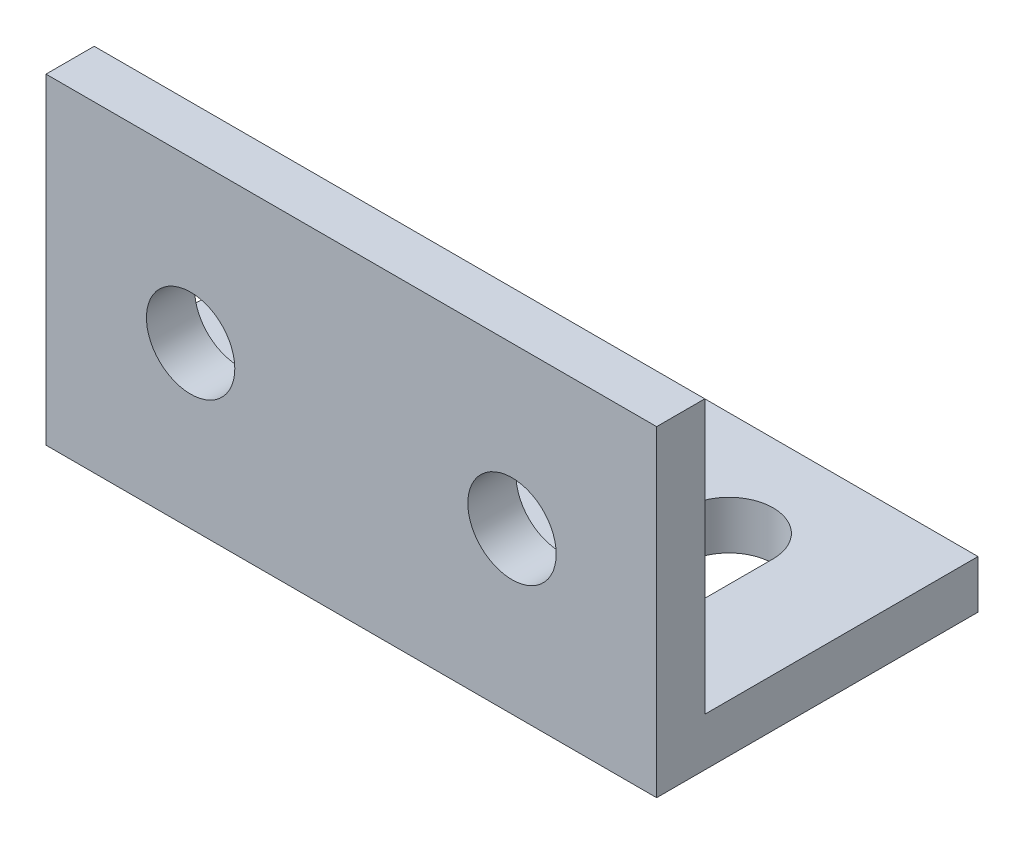
ISO-10303-21;
HEADER;
FILE_DESCRIPTION(('STEP AP214'),'2;1');
FILE_NAME('part.step','',(''),(''),'','','');
FILE_SCHEMA(('AUTOMOTIVE_DESIGN { 1 0 10303 214 1 1 1 1 }'));
ENDSEC;
DATA;
#1=APPLICATION_CONTEXT('core data for automotive mechanical design processes');
#2=APPLICATION_PROTOCOL_DEFINITION('international standard','automotive_design',2000,#1);
#3=PRODUCT_CONTEXT('',#1,'mechanical');
#4=PRODUCT('Part','Part','',(#3));
#5=PRODUCT_RELATED_PRODUCT_CATEGORY('part','',(#4));
#6=PRODUCT_DEFINITION_FORMATION('','',#4);
#7=PRODUCT_DEFINITION_CONTEXT('part definition',#1,'design');
#8=PRODUCT_DEFINITION('design','',#6,#7);
#9=PRODUCT_DEFINITION_SHAPE('','',#8);
#10=(LENGTH_UNIT() NAMED_UNIT(*) SI_UNIT(.MILLI.,.METRE.));
#11=(NAMED_UNIT(*) PLANE_ANGLE_UNIT() SI_UNIT($,.RADIAN.));
#12=(NAMED_UNIT(*) SI_UNIT($,.STERADIAN.) SOLID_ANGLE_UNIT());
#13=UNCERTAINTY_MEASURE_WITH_UNIT(LENGTH_MEASURE(1.E-05),#10,'distance_accuracy_value','');
#14=(GEOMETRIC_REPRESENTATION_CONTEXT(3) GLOBAL_UNCERTAINTY_ASSIGNED_CONTEXT((#13)) GLOBAL_UNIT_ASSIGNED_CONTEXT((#10,
#11,#12)) REPRESENTATION_CONTEXT('',''));
#15=CARTESIAN_POINT('',(0.,0.,0.));
#16=DIRECTION('',(0.,0.,1.));
#17=DIRECTION('',(1.,0.,0.));
#18=AXIS2_PLACEMENT_3D('',#15,#16,#17);
#19=CARTESIAN_POINT('',(38.,20.,0.));
#20=DIRECTION('',(0.,0.,-1.));
#21=DIRECTION('',(0.,1.,0.));
#22=AXIS2_PLACEMENT_3D('',#19,#20,#21);
#23=PLANE('',#22);
#24=CARTESIAN_POINT('',(9.,10.,0.));
#25=DIRECTION('',(0.,0.,1.));
#26=DIRECTION('',(1.,0.,0.));
#27=AXIS2_PLACEMENT_3D('',#24,#25,#26);
#28=CIRCLE('',#27,2.75);
#29=CARTESIAN_POINT('',(11.75,10.,0.));
#30=VERTEX_POINT('',#29);
#31=EDGE_CURVE('E207',#30,#30,#28,.T.);
#32=ORIENTED_EDGE('',*,*,#31,.F.);
#33=EDGE_LOOP('',(#32));
#34=FACE_BOUND('',#33,.T.);
#35=CARTESIAN_POINT('',(29.,10.,0.));
#36=DIRECTION('',(0.,0.,1.));
#37=DIRECTION('',(1.,0.,0.));
#38=AXIS2_PLACEMENT_3D('',#35,#36,#37);
#39=CIRCLE('',#38,2.75);
#40=CARTESIAN_POINT('',(31.75,10.,0.));
#41=VERTEX_POINT('',#40);
#42=EDGE_CURVE('E176',#41,#41,#39,.T.);
#43=ORIENTED_EDGE('',*,*,#42,.F.);
#44=EDGE_LOOP('',(#43));
#45=FACE_BOUND('',#44,.T.);
#46=DIRECTION('',(0.,-1.,0.));
#47=VECTOR('',#46,1.);
#48=CARTESIAN_POINT('',(0.,20.,0.));
#49=LINE('',#48,#47);
#50=CARTESIAN_POINT('',(0.,20.,0.));
#51=VERTEX_POINT('',#50);
#52=CARTESIAN_POINT('',(0.,0.,0.));
#53=VERTEX_POINT('',#52);
#54=EDGE_CURVE('E236',#51,#53,#49,.T.);
#55=ORIENTED_EDGE('',*,*,#54,.T.);
#56=DIRECTION('',(-1.,0.,0.));
#57=VECTOR('',#56,1.);
#58=CARTESIAN_POINT('',(38.,0.,0.));
#59=LINE('',#58,#57);
#60=CARTESIAN_POINT('',(38.,0.,0.));
#61=VERTEX_POINT('',#60);
#62=EDGE_CURVE('E274',#61,#53,#59,.T.);
#63=ORIENTED_EDGE('',*,*,#62,.F.);
#64=DIRECTION('',(0.,-1.,0.));
#65=VECTOR('',#64,1.);
#66=CARTESIAN_POINT('',(38.,20.,0.));
#67=LINE('',#66,#65);
#68=CARTESIAN_POINT('',(38.,20.,0.));
#69=VERTEX_POINT('',#68);
#70=EDGE_CURVE('E215',#69,#61,#67,.T.);
#71=ORIENTED_EDGE('',*,*,#70,.F.);
#72=DIRECTION('',(-1.,0.,0.));
#73=VECTOR('',#72,1.);
#74=CARTESIAN_POINT('',(38.,20.,0.));
#75=LINE('',#74,#73);
#76=EDGE_CURVE('E235',#69,#51,#75,.T.);
#77=ORIENTED_EDGE('',*,*,#76,.T.);
#78=EDGE_LOOP('',(#55,#63,#71,#77));
#79=FACE_BOUND('',#78,.T.);
#80=ADVANCED_FACE('F39',(#34,#45,#79),#23,.F.);
#81=CARTESIAN_POINT('',(38.,0.,0.));
#82=DIRECTION('',(0.,1.,0.));
#83=DIRECTION('',(0.,0.,1.));
#84=AXIS2_PLACEMENT_3D('',#81,#82,#83);
#85=PLANE('',#84);
#86=DIRECTION('',(0.,0.,1.));
#87=VECTOR('',#86,1.);
#88=CARTESIAN_POINT('',(11.75,0.,-13.5));
#89=LINE('',#88,#87);
#90=CARTESIAN_POINT('',(11.75,0.,-13.5));
#91=VERTEX_POINT('',#90);
#92=CARTESIAN_POINT('',(11.75,0.,-6.5));
#93=VERTEX_POINT('',#92);
#94=EDGE_CURVE('E158',#91,#93,#89,.T.);
#95=ORIENTED_EDGE('',*,*,#94,.F.);
#96=CARTESIAN_POINT('',(9.,0.,-13.5));
#97=DIRECTION('',(0.,-1.,0.));
#98=DIRECTION('',(0.,0.,-1.));
#99=AXIS2_PLACEMENT_3D('',#96,#97,#98);
#100=CIRCLE('',#99,2.75);
#101=CARTESIAN_POINT('',(6.25000000000001,0.,-13.5));
#102=VERTEX_POINT('',#101);
#103=EDGE_CURVE('E54',#102,#91,#100,.T.);
#104=ORIENTED_EDGE('',*,*,#103,.F.);
#105=DIRECTION('',(0.,0.,-1.));
#106=VECTOR('',#105,1.);
#107=CARTESIAN_POINT('',(6.25000000000001,0.,-13.5));
#108=LINE('',#107,#106);
#109=CARTESIAN_POINT('',(6.25,0.,-6.5));
#110=VERTEX_POINT('',#109);
#111=EDGE_CURVE('E166',#110,#102,#108,.T.);
#112=ORIENTED_EDGE('',*,*,#111,.F.);
#113=CARTESIAN_POINT('',(9.,0.,-6.5));
#114=DIRECTION('',(0.,-1.,0.));
#115=DIRECTION('',(0.,0.,-1.));
#116=AXIS2_PLACEMENT_3D('',#113,#114,#115);
#117=CIRCLE('',#116,2.75);
#118=EDGE_CURVE('E147',#93,#110,#117,.T.);
#119=ORIENTED_EDGE('',*,*,#118,.F.);
#120=EDGE_LOOP('',(#95,#104,#112,#119));
#121=FACE_BOUND('',#120,.T.);
#122=DIRECTION('',(0.,0.,1.));
#123=VECTOR('',#122,1.);
#124=CARTESIAN_POINT('',(31.75,0.,-13.5));
#125=LINE('',#124,#123);
#126=CARTESIAN_POINT('',(31.75,0.,-13.5));
#127=VERTEX_POINT('',#126);
#128=CARTESIAN_POINT('',(31.75,0.,-6.5));
#129=VERTEX_POINT('',#128);
#130=EDGE_CURVE('E183',#127,#129,#125,.T.);
#131=ORIENTED_EDGE('',*,*,#130,.F.);
#132=CARTESIAN_POINT('',(29.,0.,-13.5));
#133=DIRECTION('',(0.,-1.,0.));
#134=DIRECTION('',(0.,0.,-1.));
#135=AXIS2_PLACEMENT_3D('',#132,#133,#134);
#136=CIRCLE('',#135,2.75);
#137=CARTESIAN_POINT('',(26.25,0.,-13.5));
#138=VERTEX_POINT('',#137);
#139=EDGE_CURVE('E62',#138,#127,#136,.T.);
#140=ORIENTED_EDGE('',*,*,#139,.F.);
#141=DIRECTION('',(0.,0.,-1.));
#142=VECTOR('',#141,1.);
#143=CARTESIAN_POINT('',(26.25,0.,-13.5));
#144=LINE('',#143,#142);
#145=CARTESIAN_POINT('',(26.25,0.,-6.5));
#146=VERTEX_POINT('',#145);
#147=EDGE_CURVE('E191',#146,#138,#144,.T.);
#148=ORIENTED_EDGE('',*,*,#147,.F.);
#149=CARTESIAN_POINT('',(29.,0.,-6.5));
#150=DIRECTION('',(0.,-1.,0.));
#151=DIRECTION('',(0.,0.,-1.));
#152=AXIS2_PLACEMENT_3D('',#149,#150,#151);
#153=CIRCLE('',#152,2.75);
#154=EDGE_CURVE('E187',#129,#146,#153,.T.);
#155=ORIENTED_EDGE('',*,*,#154,.F.);
#156=EDGE_LOOP('',(#131,#140,#148,#155));
#157=FACE_BOUND('',#156,.T.);
#158=DIRECTION('',(0.,0.,-1.));
#159=VECTOR('',#158,1.);
#160=CARTESIAN_POINT('',(0.,0.,0.));
#161=LINE('',#160,#159);
#162=CARTESIAN_POINT('',(0.,0.,-20.));
#163=VERTEX_POINT('',#162);
#164=EDGE_CURVE('E240',#53,#163,#161,.T.);
#165=ORIENTED_EDGE('',*,*,#164,.T.);
#166=DIRECTION('',(-1.,0.,0.));
#167=VECTOR('',#166,1.);
#168=CARTESIAN_POINT('',(38.,0.,-20.));
#169=LINE('',#168,#167);
#170=CARTESIAN_POINT('',(38.,0.,-20.));
#171=VERTEX_POINT('',#170);
#172=EDGE_CURVE('E270',#171,#163,#169,.T.);
#173=ORIENTED_EDGE('',*,*,#172,.F.);
#174=DIRECTION('',(0.,0.,-1.));
#175=VECTOR('',#174,1.);
#176=CARTESIAN_POINT('',(38.,0.,0.));
#177=LINE('',#176,#175);
#178=EDGE_CURVE('E219',#61,#171,#177,.T.);
#179=ORIENTED_EDGE('',*,*,#178,.F.);
#180=ORIENTED_EDGE('',*,*,#62,.T.);
#181=EDGE_LOOP('',(#165,#173,#179,#180));
#182=FACE_BOUND('',#181,.T.);
#183=ADVANCED_FACE('F163',(#121,#157,#182),#85,.F.);
#184=CARTESIAN_POINT('',(38.,0.,-20.));
#185=DIRECTION('',(0.,0.,1.));
#186=DIRECTION('',(1.,0.,0.));
#187=AXIS2_PLACEMENT_3D('',#184,#185,#186);
#188=PLANE('',#187);
#189=DIRECTION('',(0.,1.,0.));
#190=VECTOR('',#189,1.);
#191=CARTESIAN_POINT('',(0.,0.,-20.));
#192=LINE('',#191,#190);
#193=CARTESIAN_POINT('',(0.,3.,-20.));
#194=VERTEX_POINT('',#193);
#195=EDGE_CURVE('E244',#163,#194,#192,.T.);
#196=ORIENTED_EDGE('',*,*,#195,.T.);
#197=DIRECTION('',(-1.,0.,0.));
#198=VECTOR('',#197,1.);
#199=CARTESIAN_POINT('',(38.,3.,-20.));
#200=LINE('',#199,#198);
#201=CARTESIAN_POINT('',(38.,3.,-20.));
#202=VERTEX_POINT('',#201);
#203=EDGE_CURVE('E266',#202,#194,#200,.T.);
#204=ORIENTED_EDGE('',*,*,#203,.F.);
#205=DIRECTION('',(0.,1.,0.));
#206=VECTOR('',#205,1.);
#207=CARTESIAN_POINT('',(38.,0.,-20.));
#208=LINE('',#207,#206);
#209=EDGE_CURVE('E223',#171,#202,#208,.T.);
#210=ORIENTED_EDGE('',*,*,#209,.F.);
#211=ORIENTED_EDGE('',*,*,#172,.T.);
#212=EDGE_LOOP('',(#196,#204,#210,#211));
#213=FACE_BOUND('',#212,.T.);
#214=ADVANCED_FACE('F331',(#213),#188,.F.);
#215=CARTESIAN_POINT('',(38.,3.,-20.));
#216=DIRECTION('',(0.,-1.,0.));
#217=DIRECTION('',(0.,0.,-1.));
#218=AXIS2_PLACEMENT_3D('',#215,#216,#217);
#219=PLANE('',#218);
#220=DIRECTION('',(0.,0.,-1.));
#221=VECTOR('',#220,1.);
#222=CARTESIAN_POINT('',(6.25000000000001,3.,-20.));
#223=LINE('',#222,#221);
#224=CARTESIAN_POINT('',(6.25,3.,-6.5));
#225=VERTEX_POINT('',#224);
#226=CARTESIAN_POINT('',(6.25000000000001,3.,-13.5));
#227=VERTEX_POINT('',#226);
#228=EDGE_CURVE('E47',#225,#227,#223,.T.);
#229=ORIENTED_EDGE('',*,*,#228,.T.);
#230=CARTESIAN_POINT('',(9.,3.,-13.5));
#231=DIRECTION('',(0.,-1.,0.));
#232=DIRECTION('',(0.,0.,-1.));
#233=AXIS2_PLACEMENT_3D('',#230,#231,#232);
#234=CIRCLE('',#233,2.75);
#235=CARTESIAN_POINT('',(11.75,3.,-13.5));
#236=VERTEX_POINT('',#235);
#237=EDGE_CURVE('E11',#227,#236,#234,.T.);
#238=ORIENTED_EDGE('',*,*,#237,.T.);
#239=DIRECTION('',(0.,0.,1.));
#240=VECTOR('',#239,1.);
#241=CARTESIAN_POINT('',(11.75,3.,-20.));
#242=LINE('',#241,#240);
#243=CARTESIAN_POINT('',(11.75,3.,-6.5));
#244=VERTEX_POINT('',#243);
#245=EDGE_CURVE('E300',#236,#244,#242,.T.);
#246=ORIENTED_EDGE('',*,*,#245,.T.);
#247=CARTESIAN_POINT('',(9.,3.,-6.5));
#248=DIRECTION('',(0.,-1.,0.));
#249=DIRECTION('',(0.,0.,-1.));
#250=AXIS2_PLACEMENT_3D('',#247,#248,#249);
#251=CIRCLE('',#250,2.75);
#252=EDGE_CURVE('E150',#244,#225,#251,.T.);
#253=ORIENTED_EDGE('',*,*,#252,.T.);
#254=EDGE_LOOP('',(#229,#238,#246,#253));
#255=FACE_BOUND('',#254,.T.);
#256=DIRECTION('',(0.,0.,-1.));
#257=VECTOR('',#256,1.);
#258=CARTESIAN_POINT('',(26.25,3.,-20.));
#259=LINE('',#258,#257);
#260=CARTESIAN_POINT('',(26.25,3.,-6.5));
#261=VERTEX_POINT('',#260);
#262=CARTESIAN_POINT('',(26.25,3.,-13.5));
#263=VERTEX_POINT('',#262);
#264=EDGE_CURVE('E292',#261,#263,#259,.T.);
#265=ORIENTED_EDGE('',*,*,#264,.T.);
#266=CARTESIAN_POINT('',(29.,3.,-13.5));
#267=DIRECTION('',(0.,-1.,0.));
#268=DIRECTION('',(0.,0.,-1.));
#269=AXIS2_PLACEMENT_3D('',#266,#267,#268);
#270=CIRCLE('',#269,2.75);
#271=CARTESIAN_POINT('',(31.75,3.,-13.5));
#272=VERTEX_POINT('',#271);
#273=EDGE_CURVE('E296',#263,#272,#270,.T.);
#274=ORIENTED_EDGE('',*,*,#273,.T.);
#275=DIRECTION('',(0.,0.,1.));
#276=VECTOR('',#275,1.);
#277=CARTESIAN_POINT('',(31.75,3.,-20.));
#278=LINE('',#277,#276);
#279=CARTESIAN_POINT('',(31.75,3.,-6.5));
#280=VERTEX_POINT('',#279);
#281=EDGE_CURVE('E278',#272,#280,#278,.T.);
#282=ORIENTED_EDGE('',*,*,#281,.T.);
#283=CARTESIAN_POINT('',(29.,3.,-6.5));
#284=DIRECTION('',(0.,-1.,0.));
#285=DIRECTION('',(0.,0.,-1.));
#286=AXIS2_PLACEMENT_3D('',#283,#284,#285);
#287=CIRCLE('',#286,2.75);
#288=EDGE_CURVE('E288',#280,#261,#287,.T.);
#289=ORIENTED_EDGE('',*,*,#288,.T.);
#290=EDGE_LOOP('',(#265,#274,#282,#289));
#291=FACE_BOUND('',#290,.T.);
#292=DIRECTION('',(0.,0.,1.));
#293=VECTOR('',#292,1.);
#294=CARTESIAN_POINT('',(0.,3.,-20.));
#295=LINE('',#294,#293);
#296=CARTESIAN_POINT('',(0.,3.,-3.));
#297=VERTEX_POINT('',#296);
#298=EDGE_CURVE('E247',#194,#297,#295,.T.);
#299=ORIENTED_EDGE('',*,*,#298,.T.);
#300=DIRECTION('',(-1.,0.,0.));
#301=VECTOR('',#300,1.);
#302=CARTESIAN_POINT('',(38.,3.,-3.));
#303=LINE('',#302,#301);
#304=CARTESIAN_POINT('',(38.,3.,-3.));
#305=VERTEX_POINT('',#304);
#306=EDGE_CURVE('E262',#305,#297,#303,.T.);
#307=ORIENTED_EDGE('',*,*,#306,.F.);
#308=DIRECTION('',(0.,0.,1.));
#309=VECTOR('',#308,1.);
#310=CARTESIAN_POINT('',(38.,3.,-20.));
#311=LINE('',#310,#309);
#312=EDGE_CURVE('E226',#202,#305,#311,.T.);
#313=ORIENTED_EDGE('',*,*,#312,.F.);
#314=ORIENTED_EDGE('',*,*,#203,.T.);
#315=EDGE_LOOP('',(#299,#307,#313,#314));
#316=FACE_BOUND('',#315,.T.);
#317=ADVANCED_FACE('F307',(#255,#291,#316),#219,.F.);
#318=CARTESIAN_POINT('',(38.,3.,-3.));
#319=DIRECTION('',(0.,0.,1.));
#320=DIRECTION('',(1.,0.,0.));
#321=AXIS2_PLACEMENT_3D('',#318,#319,#320);
#322=PLANE('',#321);
#323=CARTESIAN_POINT('',(9.,10.,-3.));
#324=DIRECTION('',(0.,0.,1.));
#325=DIRECTION('',(1.,0.,0.));
#326=AXIS2_PLACEMENT_3D('',#323,#324,#325);
#327=CIRCLE('',#326,2.75);
#328=CARTESIAN_POINT('',(11.75,10.,-3.));
#329=VERTEX_POINT('',#328);
#330=EDGE_CURVE('E241',#329,#329,#327,.T.);
#331=ORIENTED_EDGE('',*,*,#330,.T.);
#332=EDGE_LOOP('',(#331));
#333=FACE_BOUND('',#332,.T.);
#334=CARTESIAN_POINT('',(29.,10.,-3.));
#335=DIRECTION('',(0.,0.,1.));
#336=DIRECTION('',(1.,0.,0.));
#337=AXIS2_PLACEMENT_3D('',#334,#335,#336);
#338=CIRCLE('',#337,2.75);
#339=CARTESIAN_POINT('',(31.75,10.,-3.));
#340=VERTEX_POINT('',#339);
#341=EDGE_CURVE('E211',#340,#340,#338,.T.);
#342=ORIENTED_EDGE('',*,*,#341,.T.);
#343=EDGE_LOOP('',(#342));
#344=FACE_BOUND('',#343,.T.);
#345=DIRECTION('',(0.,1.,0.));
#346=VECTOR('',#345,1.);
#347=CARTESIAN_POINT('',(0.,3.,-3.));
#348=LINE('',#347,#346);
#349=CARTESIAN_POINT('',(0.,20.,-3.));
#350=VERTEX_POINT('',#349);
#351=EDGE_CURVE('E250',#297,#350,#348,.T.);
#352=ORIENTED_EDGE('',*,*,#351,.T.);
#353=DIRECTION('',(-1.,0.,0.));
#354=VECTOR('',#353,1.);
#355=CARTESIAN_POINT('',(38.,20.,-3.));
#356=LINE('',#355,#354);
#357=CARTESIAN_POINT('',(38.,20.,-3.));
#358=VERTEX_POINT('',#357);
#359=EDGE_CURVE('E258',#358,#350,#356,.T.);
#360=ORIENTED_EDGE('',*,*,#359,.F.);
#361=DIRECTION('',(0.,1.,0.));
#362=VECTOR('',#361,1.);
#363=CARTESIAN_POINT('',(38.,3.,-3.));
#364=LINE('',#363,#362);
#365=EDGE_CURVE('E229',#305,#358,#364,.T.);
#366=ORIENTED_EDGE('',*,*,#365,.F.);
#367=ORIENTED_EDGE('',*,*,#306,.T.);
#368=EDGE_LOOP('',(#352,#360,#366,#367));
#369=FACE_BOUND('',#368,.T.);
#370=ADVANCED_FACE('F357',(#333,#344,#369),#322,.F.);
#371=CARTESIAN_POINT('',(38.,20.,-3.));
#372=DIRECTION('',(0.,-1.,0.));
#373=DIRECTION('',(0.,0.,-1.));
#374=AXIS2_PLACEMENT_3D('',#371,#372,#373);
#375=PLANE('',#374);
#376=DIRECTION('',(0.,0.,1.));
#377=VECTOR('',#376,1.);
#378=CARTESIAN_POINT('',(0.,20.,-3.));
#379=LINE('',#378,#377);
#380=EDGE_CURVE('E220',#350,#51,#379,.T.);
#381=ORIENTED_EDGE('',*,*,#380,.T.);
#382=ORIENTED_EDGE('',*,*,#76,.F.);
#383=DIRECTION('',(0.,0.,1.));
#384=VECTOR('',#383,1.);
#385=CARTESIAN_POINT('',(38.,20.,-3.));
#386=LINE('',#385,#384);
#387=EDGE_CURVE('E232',#358,#69,#386,.T.);
#388=ORIENTED_EDGE('',*,*,#387,.F.);
#389=ORIENTED_EDGE('',*,*,#359,.T.);
#390=EDGE_LOOP('',(#381,#382,#388,#389));
#391=FACE_BOUND('',#390,.T.);
#392=ADVANCED_FACE('F355',(#391),#375,.F.);
#393=CARTESIAN_POINT('',(38.,0.,0.));
#394=DIRECTION('',(1.,0.,0.));
#395=DIRECTION('',(0.,0.,-1.));
#396=AXIS2_PLACEMENT_3D('',#393,#394,#395);
#397=PLANE('',#396);
#398=ORIENTED_EDGE('',*,*,#70,.T.);
#399=ORIENTED_EDGE('',*,*,#178,.T.);
#400=ORIENTED_EDGE('',*,*,#209,.T.);
#401=ORIENTED_EDGE('',*,*,#312,.T.);
#402=ORIENTED_EDGE('',*,*,#365,.T.);
#403=ORIENTED_EDGE('',*,*,#387,.T.);
#404=EDGE_LOOP('',(#398,#399,#400,#401,#402,#403));
#405=FACE_BOUND('',#404,.T.);
#406=ADVANCED_FACE('F350',(#405),#397,.T.);
#407=CARTESIAN_POINT('',(0.,0.,0.));
#408=DIRECTION('',(1.,0.,0.));
#409=DIRECTION('',(0.,0.,-1.));
#410=AXIS2_PLACEMENT_3D('',#407,#408,#409);
#411=PLANE('',#410);
#412=ORIENTED_EDGE('',*,*,#54,.F.);
#413=ORIENTED_EDGE('',*,*,#380,.F.);
#414=ORIENTED_EDGE('',*,*,#351,.F.);
#415=ORIENTED_EDGE('',*,*,#298,.F.);
#416=ORIENTED_EDGE('',*,*,#195,.F.);
#417=ORIENTED_EDGE('',*,*,#164,.F.);
#418=EDGE_LOOP('',(#412,#413,#414,#415,#416,#417));
#419=FACE_BOUND('',#418,.T.);
#420=ADVANCED_FACE('F342',(#419),#411,.F.);
#421=CARTESIAN_POINT('',(29.,10.,-20.));
#422=DIRECTION('',(0.,0.,1.));
#423=DIRECTION('',(1.,0.,0.));
#424=AXIS2_PLACEMENT_3D('',#421,#422,#423);
#425=CYLINDRICAL_SURFACE('',#424,2.75);
#426=ORIENTED_EDGE('',*,*,#42,.T.);
#427=EDGE_LOOP('',(#426));
#428=FACE_BOUND('',#427,.T.);
#429=ORIENTED_EDGE('',*,*,#341,.F.);
#430=EDGE_LOOP('',(#429));
#431=FACE_BOUND('',#430,.T.);
#432=ADVANCED_FACE('F377',(#428,#431),#425,.F.);
#433=CARTESIAN_POINT('',(9.,10.,-20.));
#434=DIRECTION('',(0.,0.,1.));
#435=DIRECTION('',(1.,0.,0.));
#436=AXIS2_PLACEMENT_3D('',#433,#434,#435);
#437=CYLINDRICAL_SURFACE('',#436,2.75);
#438=ORIENTED_EDGE('',*,*,#31,.T.);
#439=EDGE_LOOP('',(#438));
#440=FACE_BOUND('',#439,.T.);
#441=ORIENTED_EDGE('',*,*,#330,.F.);
#442=EDGE_LOOP('',(#441));
#443=FACE_BOUND('',#442,.T.);
#444=ADVANCED_FACE('F382',(#440,#443),#437,.F.);
#445=CARTESIAN_POINT('',(29.,20.,-13.5));
#446=DIRECTION('',(0.,-1.,0.));
#447=DIRECTION('',(0.,0.,-1.));
#448=AXIS2_PLACEMENT_3D('',#445,#446,#447);
#449=CYLINDRICAL_SURFACE('',#448,2.75);
#450=DIRECTION('',(0.,-1.,0.));
#451=VECTOR('',#450,1.);
#452=CARTESIAN_POINT('',(26.25,20.,-13.5));
#453=LINE('',#452,#451);
#454=EDGE_CURVE('E196',#263,#138,#453,.T.);
#455=ORIENTED_EDGE('',*,*,#454,.T.);
#456=ORIENTED_EDGE('',*,*,#139,.T.);
#457=DIRECTION('',(0.,-1.,0.));
#458=VECTOR('',#457,1.);
#459=CARTESIAN_POINT('',(31.75,20.,-13.5));
#460=LINE('',#459,#458);
#461=EDGE_CURVE('E195',#272,#127,#460,.T.);
#462=ORIENTED_EDGE('',*,*,#461,.F.);
#463=ORIENTED_EDGE('',*,*,#273,.F.);
#464=EDGE_LOOP('',(#455,#456,#462,#463));
#465=FACE_BOUND('',#464,.T.);
#466=ADVANCED_FACE('F386',(#465),#449,.F.);
#467=CARTESIAN_POINT('',(26.25,20.,-13.5));
#468=DIRECTION('',(-1.,0.,0.));
#469=DIRECTION('',(0.,0.,1.));
#470=AXIS2_PLACEMENT_3D('',#467,#468,#469);
#471=PLANE('',#470);
#472=DIRECTION('',(0.,-1.,0.));
#473=VECTOR('',#472,1.);
#474=CARTESIAN_POINT('',(26.25,20.,-6.5));
#475=LINE('',#474,#473);
#476=EDGE_CURVE('E199',#261,#146,#475,.T.);
#477=ORIENTED_EDGE('',*,*,#476,.T.);
#478=ORIENTED_EDGE('',*,*,#147,.T.);
#479=ORIENTED_EDGE('',*,*,#454,.F.);
#480=ORIENTED_EDGE('',*,*,#264,.F.);
#481=EDGE_LOOP('',(#477,#478,#479,#480));
#482=FACE_BOUND('',#481,.T.);
#483=ADVANCED_FACE('F389',(#482),#471,.F.);
#484=CARTESIAN_POINT('',(29.,20.,-6.5));
#485=DIRECTION('',(0.,-1.,0.));
#486=DIRECTION('',(0.,0.,-1.));
#487=AXIS2_PLACEMENT_3D('',#484,#485,#486);
#488=CYLINDRICAL_SURFACE('',#487,2.75);
#489=DIRECTION('',(0.,-1.,0.));
#490=VECTOR('',#489,1.);
#491=CARTESIAN_POINT('',(31.75,20.,-6.5));
#492=LINE('',#491,#490);
#493=EDGE_CURVE('E202',#280,#129,#492,.T.);
#494=ORIENTED_EDGE('',*,*,#493,.T.);
#495=ORIENTED_EDGE('',*,*,#154,.T.);
#496=ORIENTED_EDGE('',*,*,#476,.F.);
#497=ORIENTED_EDGE('',*,*,#288,.F.);
#498=EDGE_LOOP('',(#494,#495,#496,#497));
#499=FACE_BOUND('',#498,.T.);
#500=ADVANCED_FACE('F321',(#499),#488,.F.);
#501=CARTESIAN_POINT('',(31.75,20.,-13.5));
#502=DIRECTION('',(1.,0.,0.));
#503=DIRECTION('',(0.,0.,-1.));
#504=AXIS2_PLACEMENT_3D('',#501,#502,#503);
#505=PLANE('',#504);
#506=ORIENTED_EDGE('',*,*,#461,.T.);
#507=ORIENTED_EDGE('',*,*,#130,.T.);
#508=ORIENTED_EDGE('',*,*,#493,.F.);
#509=ORIENTED_EDGE('',*,*,#281,.F.);
#510=EDGE_LOOP('',(#506,#507,#508,#509));
#511=FACE_BOUND('',#510,.T.);
#512=ADVANCED_FACE('F314',(#511),#505,.F.);
#513=CARTESIAN_POINT('',(9.,20.,-13.5));
#514=DIRECTION('',(0.,-1.,0.));
#515=DIRECTION('',(0.,0.,-1.));
#516=AXIS2_PLACEMENT_3D('',#513,#514,#515);
#517=CYLINDRICAL_SURFACE('',#516,2.75);
#518=DIRECTION('',(0.,-1.,0.));
#519=VECTOR('',#518,1.);
#520=CARTESIAN_POINT('',(6.25000000000001,20.,-13.5));
#521=LINE('',#520,#519);
#522=EDGE_CURVE('E173',#227,#102,#521,.T.);
#523=ORIENTED_EDGE('',*,*,#522,.T.);
#524=ORIENTED_EDGE('',*,*,#103,.T.);
#525=DIRECTION('',(0.,-1.,0.));
#526=VECTOR('',#525,1.);
#527=CARTESIAN_POINT('',(11.75,20.,-13.5));
#528=LINE('',#527,#526);
#529=EDGE_CURVE('E155',#236,#91,#528,.T.);
#530=ORIENTED_EDGE('',*,*,#529,.F.);
#531=ORIENTED_EDGE('',*,*,#237,.F.);
#532=EDGE_LOOP('',(#523,#524,#530,#531));
#533=FACE_BOUND('',#532,.T.);
#534=ADVANCED_FACE('F312',(#533),#517,.F.);
#535=CARTESIAN_POINT('',(6.25000000000001,20.,-13.5));
#536=DIRECTION('',(-1.,0.,0.));
#537=DIRECTION('',(0.,0.,1.));
#538=AXIS2_PLACEMENT_3D('',#535,#536,#537);
#539=PLANE('',#538);
#540=DIRECTION('',(0.,-1.,0.));
#541=VECTOR('',#540,1.);
#542=CARTESIAN_POINT('',(6.25,20.,-6.5));
#543=LINE('',#542,#541);
#544=EDGE_CURVE('E154',#225,#110,#543,.T.);
#545=ORIENTED_EDGE('',*,*,#544,.T.);
#546=ORIENTED_EDGE('',*,*,#111,.T.);
#547=ORIENTED_EDGE('',*,*,#522,.F.);
#548=ORIENTED_EDGE('',*,*,#228,.F.);
#549=EDGE_LOOP('',(#545,#546,#547,#548));
#550=FACE_BOUND('',#549,.T.);
#551=ADVANCED_FACE('F311',(#550),#539,.F.);
#552=CARTESIAN_POINT('',(9.,20.,-6.5));
#553=DIRECTION('',(0.,-1.,0.));
#554=DIRECTION('',(0.,0.,-1.));
#555=AXIS2_PLACEMENT_3D('',#552,#553,#554);
#556=CYLINDRICAL_SURFACE('',#555,2.75);
#557=DIRECTION('',(0.,-1.,0.));
#558=VECTOR('',#557,1.);
#559=CARTESIAN_POINT('',(11.75,20.,-6.5));
#560=LINE('',#559,#558);
#561=EDGE_CURVE('E142',#244,#93,#560,.T.);
#562=ORIENTED_EDGE('',*,*,#561,.T.);
#563=ORIENTED_EDGE('',*,*,#118,.T.);
#564=ORIENTED_EDGE('',*,*,#544,.F.);
#565=ORIENTED_EDGE('',*,*,#252,.F.);
#566=EDGE_LOOP('',(#562,#563,#564,#565));
#567=FACE_BOUND('',#566,.T.);
#568=ADVANCED_FACE('F144',(#567),#556,.F.);
#569=CARTESIAN_POINT('',(11.75,20.,-13.5));
#570=DIRECTION('',(1.,0.,0.));
#571=DIRECTION('',(0.,0.,-1.));
#572=AXIS2_PLACEMENT_3D('',#569,#570,#571);
#573=PLANE('',#572);
#574=ORIENTED_EDGE('',*,*,#529,.T.);
#575=ORIENTED_EDGE('',*,*,#94,.T.);
#576=ORIENTED_EDGE('',*,*,#561,.F.);
#577=ORIENTED_EDGE('',*,*,#245,.F.);
#578=EDGE_LOOP('',(#574,#575,#576,#577));
#579=FACE_BOUND('',#578,.T.);
#580=ADVANCED_FACE('F159',(#579),#573,.F.);
#581=CLOSED_SHELL('',(#80,#183,#214,#317,#370,#392,#406,#420,#432,#444,#466,#483,#500,#512,#534,
#551,#568,#580));
#582=MANIFOLD_SOLID_BREP('B2',#581);
#583=ADVANCED_BREP_SHAPE_REPRESENTATION('',(#18,#582),#14);
#584=SHAPE_DEFINITION_REPRESENTATION(#9,#583);
ENDSEC;
END-ISO-10303-21;
